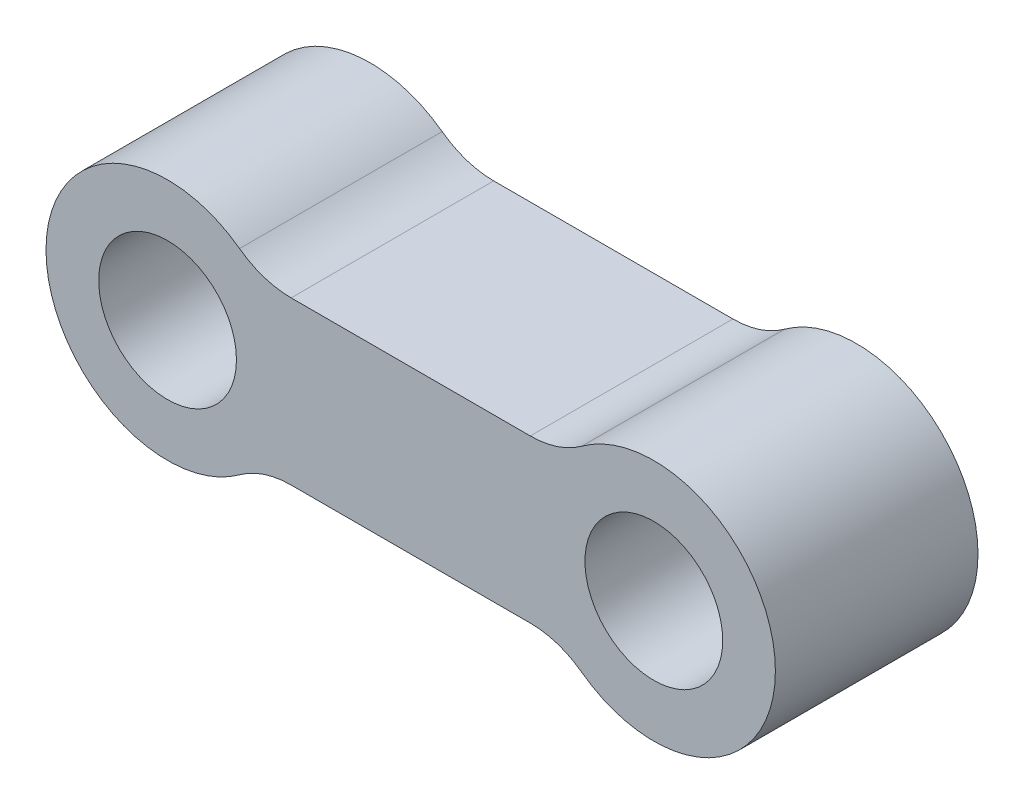
ISO-10303-21;
HEADER;
FILE_DESCRIPTION(('STEP AP214'),'2;1');
FILE_NAME('part.step','',(''),(''),'','','');
FILE_SCHEMA(('AUTOMOTIVE_DESIGN { 1 0 10303 214 1 1 1 1 }'));
ENDSEC;
DATA;
#1=APPLICATION_CONTEXT('core data for automotive mechanical design processes');
#2=APPLICATION_PROTOCOL_DEFINITION('international standard','automotive_design',2000,#1);
#3=PRODUCT_CONTEXT('',#1,'mechanical');
#4=PRODUCT('Part','Part','',(#3));
#5=PRODUCT_RELATED_PRODUCT_CATEGORY('part','',(#4));
#6=PRODUCT_DEFINITION_FORMATION('','',#4);
#7=PRODUCT_DEFINITION_CONTEXT('part definition',#1,'design');
#8=PRODUCT_DEFINITION('design','',#6,#7);
#9=PRODUCT_DEFINITION_SHAPE('','',#8);
#10=(LENGTH_UNIT() NAMED_UNIT(*) SI_UNIT(.MILLI.,.METRE.));
#11=(NAMED_UNIT(*) PLANE_ANGLE_UNIT() SI_UNIT($,.RADIAN.));
#12=(NAMED_UNIT(*) SI_UNIT($,.STERADIAN.) SOLID_ANGLE_UNIT());
#13=UNCERTAINTY_MEASURE_WITH_UNIT(LENGTH_MEASURE(1.E-05),#10,'distance_accuracy_value','');
#14=(GEOMETRIC_REPRESENTATION_CONTEXT(3) GLOBAL_UNCERTAINTY_ASSIGNED_CONTEXT((#13)) GLOBAL_UNIT_ASSIGNED_CONTEXT((#10,
#11,#12)) REPRESENTATION_CONTEXT('',''));
#15=CARTESIAN_POINT('',(0.,0.,0.));
#16=DIRECTION('',(0.,0.,1.));
#17=DIRECTION('',(1.,0.,0.));
#18=AXIS2_PLACEMENT_3D('',#15,#16,#17);
#19=CARTESIAN_POINT('',(-7.3776848355163,10.3699376933436,12.5));
#20=DIRECTION('',(0.,0.,1.));
#21=DIRECTION('',(1.,0.,0.));
#22=AXIS2_PLACEMENT_3D('',#19,#20,#21);
#23=PLANE('',#22);
#24=CARTESIAN_POINT('',(-15.,0.,12.5));
#25=DIRECTION('',(0.,0.,1.));
#26=DIRECTION('',(1.,0.,0.));
#27=AXIS2_PLACEMENT_3D('',#24,#25,#26);
#28=CIRCLE('',#27,4.25);
#29=CARTESIAN_POINT('',(-10.75,0.,12.5));
#30=VERTEX_POINT('',#29);
#31=EDGE_CURVE('E134',#30,#30,#28,.T.);
#32=ORIENTED_EDGE('',*,*,#31,.F.);
#33=EDGE_LOOP('',(#32));
#34=FACE_BOUND('',#33,.T.);
#35=CARTESIAN_POINT('',(-7.3776848355163,10.3699376933436,12.5));
#36=DIRECTION('',(0.,0.,-1.));
#37=DIRECTION('',(1.,0.,0.));
#38=AXIS2_PLACEMENT_3D('',#35,#36,#37);
#39=CIRCLE('',#38,5.36993769334362);
#40=CARTESIAN_POINT('',(-7.3776848355163,5.,12.5));
#41=VERTEX_POINT('',#40);
#42=CARTESIAN_POINT('',(-10.5580698915742,6.04311649001241,12.5));
#43=VERTEX_POINT('',#42);
#44=EDGE_CURVE('E145',#41,#43,#39,.T.);
#45=ORIENTED_EDGE('',*,*,#44,.T.);
#46=CARTESIAN_POINT('',(-15.,0.,12.5));
#47=DIRECTION('',(0.,0.,1.));
#48=DIRECTION('',(1.,0.,0.));
#49=AXIS2_PLACEMENT_3D('',#46,#47,#48);
#50=CIRCLE('',#49,7.5);
#51=CARTESIAN_POINT('',(-10.5580698915741,-6.04311649001241,12.5));
#52=VERTEX_POINT('',#51);
#53=EDGE_CURVE('E93',#43,#52,#50,.T.);
#54=ORIENTED_EDGE('',*,*,#53,.T.);
#55=CARTESIAN_POINT('',(-7.37768483551629,-10.3699376933436,12.5));
#56=DIRECTION('',(0.,0.,-1.));
#57=DIRECTION('',(-1.,0.,0.));
#58=AXIS2_PLACEMENT_3D('',#55,#56,#57);
#59=CIRCLE('',#58,5.36993769334362);
#60=CARTESIAN_POINT('',(-7.3776848355163,-5.,12.5));
#61=VERTEX_POINT('',#60);
#62=EDGE_CURVE('E160',#52,#61,#59,.T.);
#63=ORIENTED_EDGE('',*,*,#62,.T.);
#64=DIRECTION('',(1.,0.,0.));
#65=VECTOR('',#64,1.);
#66=CARTESIAN_POINT('',(-7.3776848355163,-5.,12.5));
#67=LINE('',#66,#65);
#68=CARTESIAN_POINT('',(7.3776848355163,-4.99999999999999,12.5));
#69=VERTEX_POINT('',#68);
#70=EDGE_CURVE('E173',#61,#69,#67,.T.);
#71=ORIENTED_EDGE('',*,*,#70,.T.);
#72=CARTESIAN_POINT('',(7.37768483551631,-10.3699376933436,12.5));
#73=DIRECTION('',(0.,0.,-1.));
#74=DIRECTION('',(1.,0.,0.));
#75=AXIS2_PLACEMENT_3D('',#72,#73,#74);
#76=CIRCLE('',#75,5.36993769334362);
#77=CARTESIAN_POINT('',(10.5580698915742,-6.0431164900124,12.5));
#78=VERTEX_POINT('',#77);
#79=EDGE_CURVE('E112',#69,#78,#76,.T.);
#80=ORIENTED_EDGE('',*,*,#79,.T.);
#81=CARTESIAN_POINT('',(15.,0.,12.5));
#82=DIRECTION('',(0.,0.,1.));
#83=DIRECTION('',(1.,0.,0.));
#84=AXIS2_PLACEMENT_3D('',#81,#82,#83);
#85=CIRCLE('',#84,7.5);
#86=CARTESIAN_POINT('',(10.5580698915742,6.04311649001242,12.5));
#87=VERTEX_POINT('',#86);
#88=EDGE_CURVE('E106',#78,#87,#85,.T.);
#89=ORIENTED_EDGE('',*,*,#88,.T.);
#90=CARTESIAN_POINT('',(7.3776848355163,10.3699376933436,12.5));
#91=DIRECTION('',(0.,0.,-1.));
#92=DIRECTION('',(-1.,0.,0.));
#93=AXIS2_PLACEMENT_3D('',#90,#91,#92);
#94=CIRCLE('',#93,5.36993769334362);
#95=CARTESIAN_POINT('',(7.3776848355163,5.,12.5));
#96=VERTEX_POINT('',#95);
#97=EDGE_CURVE('E110',#87,#96,#94,.T.);
#98=ORIENTED_EDGE('',*,*,#97,.T.);
#99=DIRECTION('',(-1.,0.,0.));
#100=VECTOR('',#99,1.);
#101=CARTESIAN_POINT('',(-7.3776848355163,5.,12.5));
#102=LINE('',#101,#100);
#103=EDGE_CURVE('E50',#96,#41,#102,.T.);
#104=ORIENTED_EDGE('',*,*,#103,.T.);
#105=EDGE_LOOP('',(#45,#54,#63,#71,#80,#89,#98,#104));
#106=FACE_BOUND('',#105,.T.);
#107=CARTESIAN_POINT('',(15.,0.,12.5));
#108=DIRECTION('',(0.,0.,1.));
#109=DIRECTION('',(1.,0.,0.));
#110=AXIS2_PLACEMENT_3D('',#107,#108,#109);
#111=CIRCLE('',#110,4.25);
#112=CARTESIAN_POINT('',(19.25,0.,12.5));
#113=VERTEX_POINT('',#112);
#114=EDGE_CURVE('E182',#113,#113,#111,.T.);
#115=ORIENTED_EDGE('',*,*,#114,.F.);
#116=EDGE_LOOP('',(#115));
#117=FACE_BOUND('',#116,.T.);
#118=ADVANCED_FACE('F33',(#34,#106,#117),#23,.T.);
#119=CARTESIAN_POINT('',(-7.3776848355163,10.3699376933436,0.));
#120=DIRECTION('',(0.,0.,1.));
#121=DIRECTION('',(1.,0.,0.));
#122=AXIS2_PLACEMENT_3D('',#119,#120,#121);
#123=PLANE('',#122);
#124=CARTESIAN_POINT('',(-7.3776848355163,10.3699376933436,0.));
#125=DIRECTION('',(0.,0.,-1.));
#126=DIRECTION('',(1.,0.,0.));
#127=AXIS2_PLACEMENT_3D('',#124,#125,#126);
#128=CIRCLE('',#127,5.36993769334362);
#129=CARTESIAN_POINT('',(-7.3776848355163,5.,0.));
#130=VERTEX_POINT('',#129);
#131=CARTESIAN_POINT('',(-10.5580698915742,6.04311649001241,0.));
#132=VERTEX_POINT('',#131);
#133=EDGE_CURVE('E130',#130,#132,#128,.T.);
#134=ORIENTED_EDGE('',*,*,#133,.F.);
#135=DIRECTION('',(-1.,0.,0.));
#136=VECTOR('',#135,1.);
#137=CARTESIAN_POINT('',(-7.3776848355163,5.,0.));
#138=LINE('',#137,#136);
#139=CARTESIAN_POINT('',(7.3776848355163,5.,0.));
#140=VERTEX_POINT('',#139);
#141=EDGE_CURVE('E85',#140,#130,#138,.T.);
#142=ORIENTED_EDGE('',*,*,#141,.F.);
#143=CARTESIAN_POINT('',(7.3776848355163,10.3699376933436,0.));
#144=DIRECTION('',(0.,0.,-1.));
#145=DIRECTION('',(-1.,0.,0.));
#146=AXIS2_PLACEMENT_3D('',#143,#144,#145);
#147=CIRCLE('',#146,5.36993769334362);
#148=CARTESIAN_POINT('',(10.5580698915742,6.04311649001242,0.));
#149=VERTEX_POINT('',#148);
#150=EDGE_CURVE('E79',#149,#140,#147,.T.);
#151=ORIENTED_EDGE('',*,*,#150,.F.);
#152=CARTESIAN_POINT('',(15.,0.,0.));
#153=DIRECTION('',(0.,0.,1.));
#154=DIRECTION('',(1.,0.,0.));
#155=AXIS2_PLACEMENT_3D('',#152,#153,#154);
#156=CIRCLE('',#155,7.5);
#157=CARTESIAN_POINT('',(10.5580698915742,-6.0431164900124,0.));
#158=VERTEX_POINT('',#157);
#159=EDGE_CURVE('E120',#158,#149,#156,.T.);
#160=ORIENTED_EDGE('',*,*,#159,.F.);
#161=CARTESIAN_POINT('',(7.37768483551631,-10.3699376933436,0.));
#162=DIRECTION('',(0.,0.,-1.));
#163=DIRECTION('',(1.,0.,0.));
#164=AXIS2_PLACEMENT_3D('',#161,#162,#163);
#165=CIRCLE('',#164,5.36993769334362);
#166=CARTESIAN_POINT('',(7.3776848355163,-4.99999999999999,0.));
#167=VERTEX_POINT('',#166);
#168=EDGE_CURVE('E140',#167,#158,#165,.T.);
#169=ORIENTED_EDGE('',*,*,#168,.F.);
#170=DIRECTION('',(1.,0.,0.));
#171=VECTOR('',#170,1.);
#172=CARTESIAN_POINT('',(-7.3776848355163,-5.,0.));
#173=LINE('',#172,#171);
#174=CARTESIAN_POINT('',(-7.3776848355163,-5.,0.));
#175=VERTEX_POINT('',#174);
#176=EDGE_CURVE('E138',#175,#167,#173,.T.);
#177=ORIENTED_EDGE('',*,*,#176,.F.);
#178=CARTESIAN_POINT('',(-7.37768483551629,-10.3699376933436,0.));
#179=DIRECTION('',(0.,0.,-1.));
#180=DIRECTION('',(-1.,0.,0.));
#181=AXIS2_PLACEMENT_3D('',#178,#179,#180);
#182=CIRCLE('',#181,5.36993769334362);
#183=CARTESIAN_POINT('',(-10.5580698915741,-6.04311649001241,0.));
#184=VERTEX_POINT('',#183);
#185=EDGE_CURVE('E136',#184,#175,#182,.T.);
#186=ORIENTED_EDGE('',*,*,#185,.F.);
#187=CARTESIAN_POINT('',(-15.,0.,0.));
#188=DIRECTION('',(0.,0.,1.));
#189=DIRECTION('',(1.,0.,0.));
#190=AXIS2_PLACEMENT_3D('',#187,#188,#189);
#191=CIRCLE('',#190,7.5);
#192=EDGE_CURVE('E133',#132,#184,#191,.T.);
#193=ORIENTED_EDGE('',*,*,#192,.F.);
#194=EDGE_LOOP('',(#134,#142,#151,#160,#169,#177,#186,#193));
#195=FACE_BOUND('',#194,.T.);
#196=CARTESIAN_POINT('',(-15.,0.,0.));
#197=DIRECTION('',(0.,0.,1.));
#198=DIRECTION('',(1.,0.,0.));
#199=AXIS2_PLACEMENT_3D('',#196,#197,#198);
#200=CIRCLE('',#199,4.25);
#201=CARTESIAN_POINT('',(-10.75,0.,0.));
#202=VERTEX_POINT('',#201);
#203=EDGE_CURVE('E179',#202,#202,#200,.T.);
#204=ORIENTED_EDGE('',*,*,#203,.T.);
#205=EDGE_LOOP('',(#204));
#206=FACE_BOUND('',#205,.T.);
#207=CARTESIAN_POINT('',(15.,0.,0.));
#208=DIRECTION('',(0.,0.,1.));
#209=DIRECTION('',(1.,0.,0.));
#210=AXIS2_PLACEMENT_3D('',#207,#208,#209);
#211=CIRCLE('',#210,4.25);
#212=CARTESIAN_POINT('',(19.25,0.,0.));
#213=VERTEX_POINT('',#212);
#214=EDGE_CURVE('E185',#213,#213,#211,.T.);
#215=ORIENTED_EDGE('',*,*,#214,.T.);
#216=EDGE_LOOP('',(#215));
#217=FACE_BOUND('',#216,.T.);
#218=ADVANCED_FACE('F164',(#195,#206,#217),#123,.F.);
#219=CARTESIAN_POINT('',(-7.3776848355163,10.3699376933436,12.5));
#220=DIRECTION('',(0.,0.,-1.));
#221=DIRECTION('',(-1.,0.,0.));
#222=AXIS2_PLACEMENT_3D('',#219,#220,#221);
#223=CYLINDRICAL_SURFACE('',#222,5.36993769334362);
#224=ORIENTED_EDGE('',*,*,#133,.T.);
#225=DIRECTION('',(0.,0.,-1.));
#226=VECTOR('',#225,1.);
#227=CARTESIAN_POINT('',(-10.5580698915742,6.04311649001241,12.5));
#228=LINE('',#227,#226);
#229=EDGE_CURVE('E11',#43,#132,#228,.T.);
#230=ORIENTED_EDGE('',*,*,#229,.F.);
#231=ORIENTED_EDGE('',*,*,#44,.F.);
#232=DIRECTION('',(0.,0.,-1.));
#233=VECTOR('',#232,1.);
#234=CARTESIAN_POINT('',(-7.3776848355163,5.,12.5));
#235=LINE('',#234,#233);
#236=EDGE_CURVE('E126',#41,#130,#235,.T.);
#237=ORIENTED_EDGE('',*,*,#236,.T.);
#238=EDGE_LOOP('',(#224,#230,#231,#237));
#239=FACE_BOUND('',#238,.T.);
#240=ADVANCED_FACE('F35',(#239),#223,.F.);
#241=CARTESIAN_POINT('',(-15.,0.,12.5));
#242=DIRECTION('',(0.,0.,-1.));
#243=DIRECTION('',(-1.,0.,0.));
#244=AXIS2_PLACEMENT_3D('',#241,#242,#243);
#245=CYLINDRICAL_SURFACE('',#244,7.5);
#246=ORIENTED_EDGE('',*,*,#192,.T.);
#247=DIRECTION('',(0.,0.,-1.));
#248=VECTOR('',#247,1.);
#249=CARTESIAN_POINT('',(-10.5580698915741,-6.04311649001241,12.5));
#250=LINE('',#249,#248);
#251=EDGE_CURVE('E42',#52,#184,#250,.T.);
#252=ORIENTED_EDGE('',*,*,#251,.F.);
#253=ORIENTED_EDGE('',*,*,#53,.F.);
#254=ORIENTED_EDGE('',*,*,#229,.T.);
#255=EDGE_LOOP('',(#246,#252,#253,#254));
#256=FACE_BOUND('',#255,.T.);
#257=ADVANCED_FACE('F217',(#256),#245,.T.);
#258=CARTESIAN_POINT('',(-7.37768483551629,-10.3699376933436,12.5));
#259=DIRECTION('',(0.,0.,-1.));
#260=DIRECTION('',(-1.,0.,0.));
#261=AXIS2_PLACEMENT_3D('',#258,#259,#260);
#262=CYLINDRICAL_SURFACE('',#261,5.36993769334362);
#263=ORIENTED_EDGE('',*,*,#185,.T.);
#264=DIRECTION('',(0.,0.,-1.));
#265=VECTOR('',#264,1.);
#266=CARTESIAN_POINT('',(-7.3776848355163,-5.,12.5));
#267=LINE('',#266,#265);
#268=EDGE_CURVE('E152',#61,#175,#267,.T.);
#269=ORIENTED_EDGE('',*,*,#268,.F.);
#270=ORIENTED_EDGE('',*,*,#62,.F.);
#271=ORIENTED_EDGE('',*,*,#251,.T.);
#272=EDGE_LOOP('',(#263,#269,#270,#271));
#273=FACE_BOUND('',#272,.T.);
#274=ADVANCED_FACE('F158',(#273),#262,.F.);
#275=CARTESIAN_POINT('',(-7.3776848355163,-5.,12.5));
#276=DIRECTION('',(0.,1.,0.));
#277=DIRECTION('',(-1.,0.,0.));
#278=AXIS2_PLACEMENT_3D('',#275,#276,#277);
#279=PLANE('',#278);
#280=ORIENTED_EDGE('',*,*,#176,.T.);
#281=DIRECTION('',(0.,0.,-1.));
#282=VECTOR('',#281,1.);
#283=CARTESIAN_POINT('',(7.3776848355163,-4.99999999999999,12.5));
#284=LINE('',#283,#282);
#285=EDGE_CURVE('E149',#69,#167,#284,.T.);
#286=ORIENTED_EDGE('',*,*,#285,.F.);
#287=ORIENTED_EDGE('',*,*,#70,.F.);
#288=ORIENTED_EDGE('',*,*,#268,.T.);
#289=EDGE_LOOP('',(#280,#286,#287,#288));
#290=FACE_BOUND('',#289,.T.);
#291=ADVANCED_FACE('F169',(#290),#279,.F.);
#292=CARTESIAN_POINT('',(7.37768483551631,-10.3699376933436,12.5));
#293=DIRECTION('',(0.,0.,-1.));
#294=DIRECTION('',(-1.,0.,0.));
#295=AXIS2_PLACEMENT_3D('',#292,#293,#294);
#296=CYLINDRICAL_SURFACE('',#295,5.36993769334362);
#297=ORIENTED_EDGE('',*,*,#168,.T.);
#298=DIRECTION('',(0.,0.,-1.));
#299=VECTOR('',#298,1.);
#300=CARTESIAN_POINT('',(10.5580698915742,-6.0431164900124,12.5));
#301=LINE('',#300,#299);
#302=EDGE_CURVE('E121',#78,#158,#301,.T.);
#303=ORIENTED_EDGE('',*,*,#302,.F.);
#304=ORIENTED_EDGE('',*,*,#79,.F.);
#305=ORIENTED_EDGE('',*,*,#285,.T.);
#306=EDGE_LOOP('',(#297,#303,#304,#305));
#307=FACE_BOUND('',#306,.T.);
#308=ADVANCED_FACE('F172',(#307),#296,.F.);
#309=CARTESIAN_POINT('',(15.,0.,12.5));
#310=DIRECTION('',(0.,0.,-1.));
#311=DIRECTION('',(-1.,0.,0.));
#312=AXIS2_PLACEMENT_3D('',#309,#310,#311);
#313=CYLINDRICAL_SURFACE('',#312,7.5);
#314=ORIENTED_EDGE('',*,*,#159,.T.);
#315=DIRECTION('',(0.,0.,-1.));
#316=VECTOR('',#315,1.);
#317=CARTESIAN_POINT('',(10.5580698915742,6.04311649001242,12.5));
#318=LINE('',#317,#316);
#319=EDGE_CURVE('E117',#87,#149,#318,.T.);
#320=ORIENTED_EDGE('',*,*,#319,.F.);
#321=ORIENTED_EDGE('',*,*,#88,.F.);
#322=ORIENTED_EDGE('',*,*,#302,.T.);
#323=EDGE_LOOP('',(#314,#320,#321,#322));
#324=FACE_BOUND('',#323,.T.);
#325=ADVANCED_FACE('F118',(#324),#313,.T.);
#326=CARTESIAN_POINT('',(7.3776848355163,10.3699376933436,12.5));
#327=DIRECTION('',(0.,0.,-1.));
#328=DIRECTION('',(-1.,0.,0.));
#329=AXIS2_PLACEMENT_3D('',#326,#327,#328);
#330=CYLINDRICAL_SURFACE('',#329,5.36993769334362);
#331=ORIENTED_EDGE('',*,*,#150,.T.);
#332=DIRECTION('',(0.,0.,-1.));
#333=VECTOR('',#332,1.);
#334=CARTESIAN_POINT('',(7.3776848355163,5.,12.5));
#335=LINE('',#334,#333);
#336=EDGE_CURVE('E122',#96,#140,#335,.T.);
#337=ORIENTED_EDGE('',*,*,#336,.F.);
#338=ORIENTED_EDGE('',*,*,#97,.F.);
#339=ORIENTED_EDGE('',*,*,#319,.T.);
#340=EDGE_LOOP('',(#331,#337,#338,#339));
#341=FACE_BOUND('',#340,.T.);
#342=ADVANCED_FACE('F124',(#341),#330,.F.);
#343=CARTESIAN_POINT('',(-7.3776848355163,5.,12.5));
#344=DIRECTION('',(0.,-1.,0.));
#345=DIRECTION('',(0.,0.,-1.));
#346=AXIS2_PLACEMENT_3D('',#343,#344,#345);
#347=PLANE('',#346);
#348=ORIENTED_EDGE('',*,*,#141,.T.);
#349=ORIENTED_EDGE('',*,*,#236,.F.);
#350=ORIENTED_EDGE('',*,*,#103,.F.);
#351=ORIENTED_EDGE('',*,*,#336,.T.);
#352=EDGE_LOOP('',(#348,#349,#350,#351));
#353=FACE_BOUND('',#352,.T.);
#354=ADVANCED_FACE('F205',(#353),#347,.F.);
#355=CARTESIAN_POINT('',(-15.,0.,12.5));
#356=DIRECTION('',(0.,0.,-1.));
#357=DIRECTION('',(-1.,0.,0.));
#358=AXIS2_PLACEMENT_3D('',#355,#356,#357);
#359=CYLINDRICAL_SURFACE('',#358,4.25);
#360=ORIENTED_EDGE('',*,*,#31,.T.);
#361=EDGE_LOOP('',(#360));
#362=FACE_BOUND('',#361,.T.);
#363=ORIENTED_EDGE('',*,*,#203,.F.);
#364=EDGE_LOOP('',(#363));
#365=FACE_BOUND('',#364,.T.);
#366=ADVANCED_FACE('F202',(#362,#365),#359,.F.);
#367=CARTESIAN_POINT('',(15.,0.,12.5));
#368=DIRECTION('',(0.,0.,-1.));
#369=DIRECTION('',(-1.,0.,0.));
#370=AXIS2_PLACEMENT_3D('',#367,#368,#369);
#371=CYLINDRICAL_SURFACE('',#370,4.25);
#372=ORIENTED_EDGE('',*,*,#114,.T.);
#373=EDGE_LOOP('',(#372));
#374=FACE_BOUND('',#373,.T.);
#375=ORIENTED_EDGE('',*,*,#214,.F.);
#376=EDGE_LOOP('',(#375));
#377=FACE_BOUND('',#376,.T.);
#378=ADVANCED_FACE('F191',(#374,#377),#371,.F.);
#379=CLOSED_SHELL('',(#118,#218,#240,#257,#274,#291,#308,#325,#342,#354,#366,#378));
#380=MANIFOLD_SOLID_BREP('B2',#379);
#381=ADVANCED_BREP_SHAPE_REPRESENTATION('',(#18,#380),#14);
#382=SHAPE_DEFINITION_REPRESENTATION(#9,#381);
ENDSEC;
END-ISO-10303-21;
